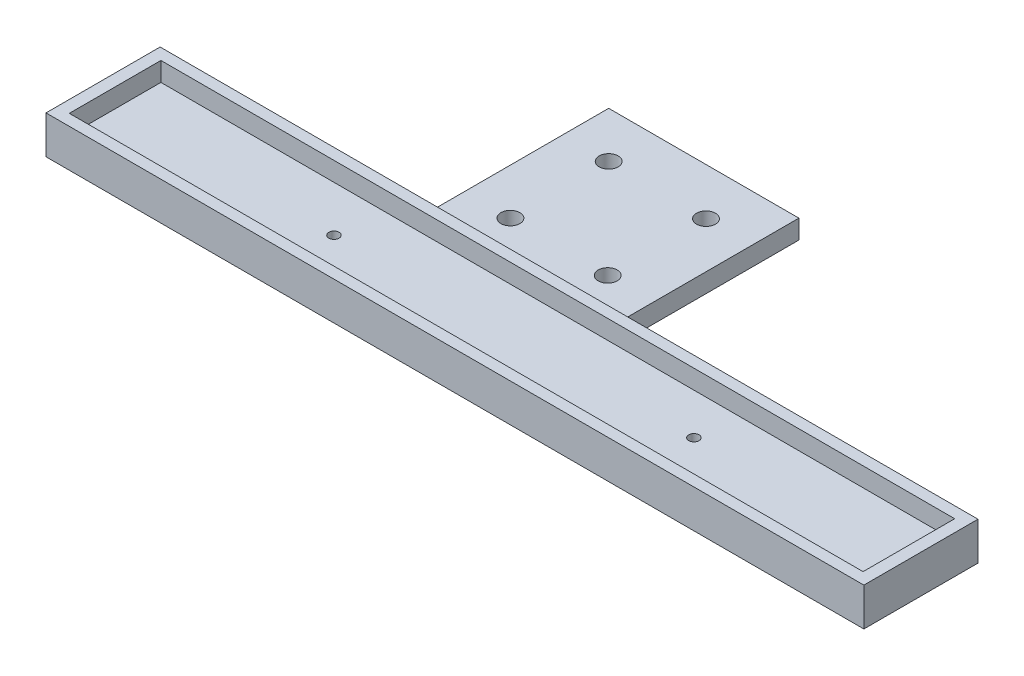
ISO-10303-21;
HEADER;
FILE_DESCRIPTION(('STEP AP214'),'2;1');
FILE_NAME('part.step','',(''),(''),'','','');
FILE_SCHEMA(('AUTOMOTIVE_DESIGN { 1 0 10303 214 1 1 1 1 }'));
ENDSEC;
DATA;
#1=APPLICATION_CONTEXT('core data for automotive mechanical design processes');
#2=APPLICATION_PROTOCOL_DEFINITION('international standard','automotive_design',2000,#1);
#3=PRODUCT_CONTEXT('',#1,'mechanical');
#4=PRODUCT('Part','Part','',(#3));
#5=PRODUCT_RELATED_PRODUCT_CATEGORY('part','',(#4));
#6=PRODUCT_DEFINITION_FORMATION('','',#4);
#7=PRODUCT_DEFINITION_CONTEXT('part definition',#1,'design');
#8=PRODUCT_DEFINITION('design','',#6,#7);
#9=PRODUCT_DEFINITION_SHAPE('','',#8);
#10=(LENGTH_UNIT() NAMED_UNIT(*) SI_UNIT(.MILLI.,.METRE.));
#11=(NAMED_UNIT(*) PLANE_ANGLE_UNIT() SI_UNIT($,.RADIAN.));
#12=(NAMED_UNIT(*) SI_UNIT($,.STERADIAN.) SOLID_ANGLE_UNIT());
#13=UNCERTAINTY_MEASURE_WITH_UNIT(LENGTH_MEASURE(1.E-05),#10,'distance_accuracy_value','');
#14=(GEOMETRIC_REPRESENTATION_CONTEXT(3) GLOBAL_UNCERTAINTY_ASSIGNED_CONTEXT((#13)) GLOBAL_UNIT_ASSIGNED_CONTEXT((#10,
#11,#12)) REPRESENTATION_CONTEXT('',''));
#15=CARTESIAN_POINT('',(0.,0.,0.));
#16=DIRECTION('',(0.,0.,1.));
#17=DIRECTION('',(1.,0.,0.));
#18=AXIS2_PLACEMENT_3D('',#15,#16,#17);
#19=CARTESIAN_POINT('',(64.4999999999998,3.,-9.00000000000003));
#20=DIRECTION('',(0.,0.,1.));
#21=DIRECTION('',(1.,0.,0.));
#22=AXIS2_PLACEMENT_3D('',#19,#20,#21);
#23=PLANE('',#22);
#24=DIRECTION('',(0.,-1.,0.));
#25=VECTOR('',#24,1.);
#26=CARTESIAN_POINT('',(6.2499999999998,0.,-9.00000000000001));
#27=LINE('',#26,#25);
#28=CARTESIAN_POINT('',(6.2499999999998,0.,-9.00000000000001));
#29=VERTEX_POINT('',#28);
#30=CARTESIAN_POINT('',(6.2499999999998,-3.,-9.00000000000001));
#31=VERTEX_POINT('',#30);
#32=EDGE_CURVE('E157',#29,#31,#27,.T.);
#33=ORIENTED_EDGE('',*,*,#32,.F.);
#34=DIRECTION('',(-1.,0.,0.));
#35=VECTOR('',#34,1.);
#36=CARTESIAN_POINT('',(-23.7500000000002,0.,-9.00000000000001));
#37=LINE('',#36,#35);
#38=CARTESIAN_POINT('',(-23.7500000000002,0.,-9.00000000000001));
#39=VERTEX_POINT('',#38);
#40=EDGE_CURVE('E129',#29,#39,#37,.T.);
#41=ORIENTED_EDGE('',*,*,#40,.T.);
#42=DIRECTION('',(0.,-1.,0.));
#43=VECTOR('',#42,1.);
#44=CARTESIAN_POINT('',(-23.7500000000002,0.,-9.00000000000001));
#45=LINE('',#44,#43);
#46=CARTESIAN_POINT('',(-23.7500000000002,-3.,-9.00000000000001));
#47=VERTEX_POINT('',#46);
#48=EDGE_CURVE('E141',#39,#47,#45,.T.);
#49=ORIENTED_EDGE('',*,*,#48,.T.);
#50=DIRECTION('',(1.,0.,0.));
#51=VECTOR('',#50,1.);
#52=CARTESIAN_POINT('',(64.4999999999998,-3.,-9.00000000000001));
#53=LINE('',#52,#51);
#54=CARTESIAN_POINT('',(-64.5000000000002,-3.,-9.00000000000001));
#55=VERTEX_POINT('',#54);
#56=EDGE_CURVE('E181',#55,#47,#53,.T.);
#57=ORIENTED_EDGE('',*,*,#56,.F.);
#58=DIRECTION('',(0.,-1.,0.));
#59=VECTOR('',#58,1.);
#60=CARTESIAN_POINT('',(-64.5000000000002,3.,-9.00000000000001));
#61=LINE('',#60,#59);
#62=CARTESIAN_POINT('',(-64.5000000000002,3.,-9.00000000000001));
#63=VERTEX_POINT('',#62);
#64=EDGE_CURVE('E221',#63,#55,#61,.T.);
#65=ORIENTED_EDGE('',*,*,#64,.F.);
#66=DIRECTION('',(-1.,0.,0.));
#67=VECTOR('',#66,1.);
#68=CARTESIAN_POINT('',(64.4999999999998,3.,-9.00000000000003));
#69=LINE('',#68,#67);
#70=CARTESIAN_POINT('',(64.4999999999998,3.,-9.00000000000003));
#71=VERTEX_POINT('',#70);
#72=EDGE_CURVE('E219',#71,#63,#69,.T.);
#73=ORIENTED_EDGE('',*,*,#72,.F.);
#74=DIRECTION('',(0.,-1.,0.));
#75=VECTOR('',#74,1.);
#76=CARTESIAN_POINT('',(64.4999999999998,3.,-9.00000000000003));
#77=LINE('',#76,#75);
#78=CARTESIAN_POINT('',(64.4999999999998,-3.,-9.00000000000001));
#79=VERTEX_POINT('',#78);
#80=EDGE_CURVE('E223',#71,#79,#77,.T.);
#81=ORIENTED_EDGE('',*,*,#80,.T.);
#82=EDGE_CURVE('E180',#31,#79,#53,.T.);
#83=ORIENTED_EDGE('',*,*,#82,.F.);
#84=EDGE_LOOP('',(#33,#41,#49,#57,#65,#73,#81,#83));
#85=FACE_BOUND('',#84,.T.);
#86=ADVANCED_FACE('F33',(#85),#23,.F.);
#87=CARTESIAN_POINT('',(0.,3.,0.));
#88=DIRECTION('',(0.,1.,0.));
#89=DIRECTION('',(0.,0.,1.));
#90=AXIS2_PLACEMENT_3D('',#87,#88,#89);
#91=PLANE('',#90);
#92=DIRECTION('',(0.,0.,1.));
#93=VECTOR('',#92,1.);
#94=CARTESIAN_POINT('',(-64.5000000000002,3.,8.99999999999999));
#95=LINE('',#94,#93);
#96=CARTESIAN_POINT('',(-64.5000000000002,3.,8.99999999999999));
#97=VERTEX_POINT('',#96);
#98=EDGE_CURVE('E212',#63,#97,#95,.T.);
#99=ORIENTED_EDGE('',*,*,#98,.T.);
#100=DIRECTION('',(1.,0.,0.));
#101=VECTOR('',#100,1.);
#102=CARTESIAN_POINT('',(64.4999999999998,3.,8.99999999999997));
#103=LINE('',#102,#101);
#104=CARTESIAN_POINT('',(64.4999999999998,3.,8.99999999999997));
#105=VERTEX_POINT('',#104);
#106=EDGE_CURVE('E215',#97,#105,#103,.T.);
#107=ORIENTED_EDGE('',*,*,#106,.T.);
#108=DIRECTION('',(0.,0.,-1.));
#109=VECTOR('',#108,1.);
#110=CARTESIAN_POINT('',(64.4999999999998,3.,8.99999999999997));
#111=LINE('',#110,#109);
#112=EDGE_CURVE('E217',#105,#71,#111,.T.);
#113=ORIENTED_EDGE('',*,*,#112,.T.);
#114=ORIENTED_EDGE('',*,*,#72,.T.);
#115=EDGE_LOOP('',(#99,#107,#113,#114));
#116=FACE_BOUND('',#115,.T.);
#117=DIRECTION('',(1.,0.,0.));
#118=VECTOR('',#117,1.);
#119=CARTESIAN_POINT('',(62.5999999999998,3.,7.22499999999995));
#120=LINE('',#119,#118);
#121=CARTESIAN_POINT('',(-62.6000000000002,3.,7.22499999999995));
#122=VERTEX_POINT('',#121);
#123=CARTESIAN_POINT('',(62.5999999999998,3.,7.22499999999995));
#124=VERTEX_POINT('',#123);
#125=EDGE_CURVE('E187',#122,#124,#120,.T.);
#126=ORIENTED_EDGE('',*,*,#125,.F.);
#127=DIRECTION('',(0.,0.,1.));
#128=VECTOR('',#127,1.);
#129=CARTESIAN_POINT('',(-62.6000000000002,3.,7.22499999999995));
#130=LINE('',#129,#128);
#131=CARTESIAN_POINT('',(-62.6000000000002,3.,-7.22500000000001));
#132=VERTEX_POINT('',#131);
#133=EDGE_CURVE('E185',#132,#122,#130,.T.);
#134=ORIENTED_EDGE('',*,*,#133,.F.);
#135=DIRECTION('',(-1.,0.,0.));
#136=VECTOR('',#135,1.);
#137=CARTESIAN_POINT('',(62.5999999999998,3.,-7.22500000000001));
#138=LINE('',#137,#136);
#139=CARTESIAN_POINT('',(62.5999999999998,3.,-7.22500000000001));
#140=VERTEX_POINT('',#139);
#141=EDGE_CURVE('E192',#140,#132,#138,.T.);
#142=ORIENTED_EDGE('',*,*,#141,.F.);
#143=DIRECTION('',(0.,0.,-1.));
#144=VECTOR('',#143,1.);
#145=CARTESIAN_POINT('',(62.5999999999998,3.,7.22499999999995));
#146=LINE('',#145,#144);
#147=EDGE_CURVE('E190',#124,#140,#146,.T.);
#148=ORIENTED_EDGE('',*,*,#147,.F.);
#149=EDGE_LOOP('',(#126,#134,#142,#148));
#150=FACE_BOUND('',#149,.T.);
#151=ADVANCED_FACE('F248',(#116,#150),#91,.T.);
#152=CARTESIAN_POINT('',(-64.5000000000002,3.,8.99999999999999));
#153=DIRECTION('',(1.,0.,0.));
#154=DIRECTION('',(0.,0.,-1.));
#155=AXIS2_PLACEMENT_3D('',#152,#153,#154);
#156=PLANE('',#155);
#157=ORIENTED_EDGE('',*,*,#64,.T.);
#158=DIRECTION('',(0.,0.,-1.));
#159=VECTOR('',#158,1.);
#160=CARTESIAN_POINT('',(-64.5000000000002,-3.,8.99999999999997));
#161=LINE('',#160,#159);
#162=CARTESIAN_POINT('',(-64.5000000000002,-3.,8.99999999999997));
#163=VERTEX_POINT('',#162);
#164=EDGE_CURVE('E177',#163,#55,#161,.T.);
#165=ORIENTED_EDGE('',*,*,#164,.F.);
#166=DIRECTION('',(0.,-1.,0.));
#167=VECTOR('',#166,1.);
#168=CARTESIAN_POINT('',(-64.5000000000002,3.,8.99999999999999));
#169=LINE('',#168,#167);
#170=EDGE_CURVE('E11',#97,#163,#169,.T.);
#171=ORIENTED_EDGE('',*,*,#170,.F.);
#172=ORIENTED_EDGE('',*,*,#98,.F.);
#173=EDGE_LOOP('',(#157,#165,#171,#172));
#174=FACE_BOUND('',#173,.T.);
#175=ADVANCED_FACE('F35',(#174),#156,.F.);
#176=CARTESIAN_POINT('',(64.4999999999998,3.,8.99999999999997));
#177=DIRECTION('',(0.,0.,-1.));
#178=DIRECTION('',(-1.,0.,0.));
#179=AXIS2_PLACEMENT_3D('',#176,#177,#178);
#180=PLANE('',#179);
#181=ORIENTED_EDGE('',*,*,#170,.T.);
#182=DIRECTION('',(-1.,0.,0.));
#183=VECTOR('',#182,1.);
#184=CARTESIAN_POINT('',(64.4999999999998,-3.,8.99999999999997));
#185=LINE('',#184,#183);
#186=CARTESIAN_POINT('',(64.4999999999998,-3.,8.99999999999997));
#187=VERTEX_POINT('',#186);
#188=EDGE_CURVE('E174',#187,#163,#185,.T.);
#189=ORIENTED_EDGE('',*,*,#188,.F.);
#190=DIRECTION('',(0.,-1.,0.));
#191=VECTOR('',#190,1.);
#192=CARTESIAN_POINT('',(64.4999999999998,3.,8.99999999999997));
#193=LINE('',#192,#191);
#194=EDGE_CURVE('E41',#105,#187,#193,.T.);
#195=ORIENTED_EDGE('',*,*,#194,.F.);
#196=ORIENTED_EDGE('',*,*,#106,.F.);
#197=EDGE_LOOP('',(#181,#189,#195,#196));
#198=FACE_BOUND('',#197,.T.);
#199=ADVANCED_FACE('F233',(#198),#180,.F.);
#200=CARTESIAN_POINT('',(64.4999999999998,3.,8.99999999999997));
#201=DIRECTION('',(-1.,0.,0.));
#202=DIRECTION('',(0.,0.,1.));
#203=AXIS2_PLACEMENT_3D('',#200,#201,#202);
#204=PLANE('',#203);
#205=ORIENTED_EDGE('',*,*,#194,.T.);
#206=DIRECTION('',(0.,0.,1.));
#207=VECTOR('',#206,1.);
#208=CARTESIAN_POINT('',(64.4999999999998,-3.,8.99999999999997));
#209=LINE('',#208,#207);
#210=EDGE_CURVE('E163',#79,#187,#209,.T.);
#211=ORIENTED_EDGE('',*,*,#210,.F.);
#212=ORIENTED_EDGE('',*,*,#80,.F.);
#213=ORIENTED_EDGE('',*,*,#112,.F.);
#214=EDGE_LOOP('',(#205,#211,#212,#213));
#215=FACE_BOUND('',#214,.T.);
#216=ADVANCED_FACE('F230',(#215),#204,.F.);
#217=CARTESIAN_POINT('',(-62.6000000000002,3.,7.22499999999995));
#218=DIRECTION('',(1.,0.,0.));
#219=DIRECTION('',(0.,0.,-1.));
#220=AXIS2_PLACEMENT_3D('',#217,#218,#219);
#221=PLANE('',#220);
#222=DIRECTION('',(0.,0.,1.));
#223=VECTOR('',#222,1.);
#224=CARTESIAN_POINT('',(-62.6000000000002,0.,7.22499999999995));
#225=LINE('',#224,#223);
#226=CARTESIAN_POINT('',(-62.6000000000002,0.,-7.22500000000001));
#227=VERTEX_POINT('',#226);
#228=CARTESIAN_POINT('',(-62.6000000000002,0.,7.22499999999995));
#229=VERTEX_POINT('',#228);
#230=EDGE_CURVE('E184',#227,#229,#225,.T.);
#231=ORIENTED_EDGE('',*,*,#230,.F.);
#232=DIRECTION('',(0.,-1.,0.));
#233=VECTOR('',#232,1.);
#234=CARTESIAN_POINT('',(-62.6000000000002,3.,-7.22500000000001));
#235=LINE('',#234,#233);
#236=EDGE_CURVE('E194',#132,#227,#235,.T.);
#237=ORIENTED_EDGE('',*,*,#236,.F.);
#238=ORIENTED_EDGE('',*,*,#133,.T.);
#239=DIRECTION('',(0.,-1.,0.));
#240=VECTOR('',#239,1.);
#241=CARTESIAN_POINT('',(-62.6000000000002,3.,7.22499999999995));
#242=LINE('',#241,#240);
#243=EDGE_CURVE('E209',#122,#229,#242,.T.);
#244=ORIENTED_EDGE('',*,*,#243,.T.);
#245=EDGE_LOOP('',(#231,#237,#238,#244));
#246=FACE_BOUND('',#245,.T.);
#247=ADVANCED_FACE('F272',(#246),#221,.T.);
#248=CARTESIAN_POINT('',(62.5999999999998,3.,7.22499999999995));
#249=DIRECTION('',(0.,0.,-1.));
#250=DIRECTION('',(-1.,0.,0.));
#251=AXIS2_PLACEMENT_3D('',#248,#249,#250);
#252=PLANE('',#251);
#253=DIRECTION('',(1.,0.,0.));
#254=VECTOR('',#253,1.);
#255=CARTESIAN_POINT('',(62.5999999999998,0.,7.22499999999995));
#256=LINE('',#255,#254);
#257=CARTESIAN_POINT('',(62.5999999999998,0.,7.22499999999995));
#258=VERTEX_POINT('',#257);
#259=EDGE_CURVE('E197',#229,#258,#256,.T.);
#260=ORIENTED_EDGE('',*,*,#259,.F.);
#261=ORIENTED_EDGE('',*,*,#243,.F.);
#262=ORIENTED_EDGE('',*,*,#125,.T.);
#263=DIRECTION('',(0.,-1.,0.));
#264=VECTOR('',#263,1.);
#265=CARTESIAN_POINT('',(62.5999999999998,3.,7.22499999999995));
#266=LINE('',#265,#264);
#267=EDGE_CURVE('E207',#124,#258,#266,.T.);
#268=ORIENTED_EDGE('',*,*,#267,.T.);
#269=EDGE_LOOP('',(#260,#261,#262,#268));
#270=FACE_BOUND('',#269,.T.);
#271=ADVANCED_FACE('F313',(#270),#252,.T.);
#272=CARTESIAN_POINT('',(62.5999999999998,3.,7.22499999999995));
#273=DIRECTION('',(-1.,0.,0.));
#274=DIRECTION('',(0.,0.,1.));
#275=AXIS2_PLACEMENT_3D('',#272,#273,#274);
#276=PLANE('',#275);
#277=DIRECTION('',(0.,0.,-1.));
#278=VECTOR('',#277,1.);
#279=CARTESIAN_POINT('',(62.5999999999998,0.,7.22499999999995));
#280=LINE('',#279,#278);
#281=CARTESIAN_POINT('',(62.5999999999998,0.,-7.22500000000001));
#282=VERTEX_POINT('',#281);
#283=EDGE_CURVE('E200',#258,#282,#280,.T.);
#284=ORIENTED_EDGE('',*,*,#283,.F.);
#285=ORIENTED_EDGE('',*,*,#267,.F.);
#286=ORIENTED_EDGE('',*,*,#147,.T.);
#287=DIRECTION('',(0.,-1.,0.));
#288=VECTOR('',#287,1.);
#289=CARTESIAN_POINT('',(62.5999999999998,3.,-7.22500000000001));
#290=LINE('',#289,#288);
#291=EDGE_CURVE('E56',#140,#282,#290,.T.);
#292=ORIENTED_EDGE('',*,*,#291,.T.);
#293=EDGE_LOOP('',(#284,#285,#286,#292));
#294=FACE_BOUND('',#293,.T.);
#295=ADVANCED_FACE('F321',(#294),#276,.T.);
#296=CARTESIAN_POINT('',(62.5999999999998,3.,-7.22500000000001));
#297=DIRECTION('',(0.,0.,1.));
#298=DIRECTION('',(1.,0.,0.));
#299=AXIS2_PLACEMENT_3D('',#296,#297,#298);
#300=PLANE('',#299);
#301=DIRECTION('',(-1.,0.,0.));
#302=VECTOR('',#301,1.);
#303=CARTESIAN_POINT('',(62.5999999999998,0.,-7.22500000000001));
#304=LINE('',#303,#302);
#305=EDGE_CURVE('E188',#282,#227,#304,.T.);
#306=ORIENTED_EDGE('',*,*,#305,.F.);
#307=ORIENTED_EDGE('',*,*,#291,.F.);
#308=ORIENTED_EDGE('',*,*,#141,.T.);
#309=ORIENTED_EDGE('',*,*,#236,.T.);
#310=EDGE_LOOP('',(#306,#307,#308,#309));
#311=FACE_BOUND('',#310,.T.);
#312=ADVANCED_FACE('F329',(#311),#300,.T.);
#313=CARTESIAN_POINT('',(0.,0.,0.));
#314=DIRECTION('',(0.,1.,0.));
#315=DIRECTION('',(0.,0.,1.));
#316=AXIS2_PLACEMENT_3D('',#313,#314,#315);
#317=PLANE('',#316);
#318=CARTESIAN_POINT('',(27.9699999999998,0.,-0.72500000000001));
#319=DIRECTION('',(0.,1.,0.));
#320=DIRECTION('',(0.,0.,1.));
#321=AXIS2_PLACEMENT_3D('',#318,#319,#320);
#322=CIRCLE('',#321,0.809999999999999);
#323=CARTESIAN_POINT('',(27.9699999999998,0.,0.0849999999999887));
#324=VERTEX_POINT('',#323);
#325=EDGE_CURVE('E164',#324,#324,#322,.T.);
#326=ORIENTED_EDGE('',*,*,#325,.F.);
#327=EDGE_LOOP('',(#326));
#328=FACE_BOUND('',#327,.T.);
#329=CARTESIAN_POINT('',(-28.0800000000002,0.,0.));
#330=DIRECTION('',(0.,1.,0.));
#331=DIRECTION('',(0.,0.,1.));
#332=AXIS2_PLACEMENT_3D('',#329,#330,#331);
#333=CIRCLE('',#332,0.809999999999999);
#334=CARTESIAN_POINT('',(-28.0800000000002,0.,0.809999999999999));
#335=VERTEX_POINT('',#334);
#336=EDGE_CURVE('E156',#335,#335,#333,.T.);
#337=ORIENTED_EDGE('',*,*,#336,.F.);
#338=EDGE_LOOP('',(#337));
#339=FACE_BOUND('',#338,.T.);
#340=ORIENTED_EDGE('',*,*,#305,.T.);
#341=ORIENTED_EDGE('',*,*,#230,.T.);
#342=ORIENTED_EDGE('',*,*,#259,.T.);
#343=ORIENTED_EDGE('',*,*,#283,.T.);
#344=EDGE_LOOP('',(#340,#341,#342,#343));
#345=FACE_BOUND('',#344,.T.);
#346=ADVANCED_FACE('F337',(#328,#339,#345),#317,.T.);
#347=CARTESIAN_POINT('',(0.,-3.,0.));
#348=DIRECTION('',(0.,1.,0.));
#349=DIRECTION('',(0.,0.,1.));
#350=AXIS2_PLACEMENT_3D('',#347,#348,#349);
#351=PLANE('',#350);
#352=CARTESIAN_POINT('',(27.9699999999998,-3.,-0.72500000000001));
#353=DIRECTION('',(0.,1.,0.));
#354=DIRECTION('',(0.,0.,1.));
#355=AXIS2_PLACEMENT_3D('',#352,#353,#354);
#356=CIRCLE('',#355,0.809999999999999);
#357=CARTESIAN_POINT('',(27.9699999999998,-3.,0.0849999999999887));
#358=VERTEX_POINT('',#357);
#359=EDGE_CURVE('E160',#358,#358,#356,.T.);
#360=ORIENTED_EDGE('',*,*,#359,.T.);
#361=EDGE_LOOP('',(#360));
#362=FACE_BOUND('',#361,.T.);
#363=CARTESIAN_POINT('',(-28.0800000000002,-3.,0.));
#364=DIRECTION('',(0.,1.,0.));
#365=DIRECTION('',(0.,0.,1.));
#366=AXIS2_PLACEMENT_3D('',#363,#364,#365);
#367=CIRCLE('',#366,0.809999999999999);
#368=CARTESIAN_POINT('',(-28.0800000000002,-3.,0.809999999999999));
#369=VERTEX_POINT('',#368);
#370=EDGE_CURVE('E167',#369,#369,#367,.T.);
#371=ORIENTED_EDGE('',*,*,#370,.T.);
#372=EDGE_LOOP('',(#371));
#373=FACE_BOUND('',#372,.T.);
#374=ORIENTED_EDGE('',*,*,#210,.T.);
#375=ORIENTED_EDGE('',*,*,#188,.T.);
#376=ORIENTED_EDGE('',*,*,#164,.T.);
#377=ORIENTED_EDGE('',*,*,#56,.T.);
#378=DIRECTION('',(0.,0.,-1.));
#379=VECTOR('',#378,1.);
#380=CARTESIAN_POINT('',(-23.7500000000002,-3.,-9.00000000000001));
#381=LINE('',#380,#379);
#382=CARTESIAN_POINT('',(-23.7500000000002,-3.,-39.));
#383=VERTEX_POINT('',#382);
#384=EDGE_CURVE('E48',#47,#383,#381,.T.);
#385=ORIENTED_EDGE('',*,*,#384,.T.);
#386=DIRECTION('',(1.,0.,0.));
#387=VECTOR('',#386,1.);
#388=CARTESIAN_POINT('',(-23.7500000000002,-3.,-39.));
#389=LINE('',#388,#387);
#390=CARTESIAN_POINT('',(6.2499999999998,-3.,-39.));
#391=VERTEX_POINT('',#390);
#392=EDGE_CURVE('E126',#383,#391,#389,.T.);
#393=ORIENTED_EDGE('',*,*,#392,.T.);
#394=DIRECTION('',(0.,0.,1.));
#395=VECTOR('',#394,1.);
#396=CARTESIAN_POINT('',(6.2499999999998,-3.,-9.00000000000001));
#397=LINE('',#396,#395);
#398=EDGE_CURVE('E142',#391,#31,#397,.T.);
#399=ORIENTED_EDGE('',*,*,#398,.T.);
#400=ORIENTED_EDGE('',*,*,#82,.T.);
#401=EDGE_LOOP('',(#374,#375,#376,#377,#385,#393,#399,#400));
#402=FACE_BOUND('',#401,.T.);
#403=CARTESIAN_POINT('',(-16.4992018378027,-3.,-16.2500000205504));
#404=DIRECTION('',(0.,-1.,0.));
#405=DIRECTION('',(0.,0.,-1.));
#406=AXIS2_PLACEMENT_3D('',#403,#404,#405);
#407=CIRCLE('',#406,1.5);
#408=CARTESIAN_POINT('',(-16.4992018378027,-3.,-17.7500000205504));
#409=VERTEX_POINT('',#408);
#410=EDGE_CURVE('E453',#409,#409,#407,.T.);
#411=ORIENTED_EDGE('',*,*,#410,.F.);
#412=EDGE_LOOP('',(#411));
#413=FACE_BOUND('',#412,.T.);
#414=CARTESIAN_POINT('',(-1.0000000000002,-3.,-16.0927028779885));
#415=DIRECTION('',(0.,-1.,0.));
#416=DIRECTION('',(0.,0.,-1.));
#417=AXIS2_PLACEMENT_3D('',#414,#415,#416);
#418=CIRCLE('',#417,1.5);
#419=CARTESIAN_POINT('',(-1.0000000000002,-3.,-17.5927028779885));
#420=VERTEX_POINT('',#419);
#421=EDGE_CURVE('E455',#420,#420,#418,.T.);
#422=ORIENTED_EDGE('',*,*,#421,.F.);
#423=EDGE_LOOP('',(#422));
#424=FACE_BOUND('',#423,.T.);
#425=CARTESIAN_POINT('',(-16.5000000000002,-3.,-31.75));
#426=DIRECTION('',(0.,-1.,0.));
#427=DIRECTION('',(0.,0.,-1.));
#428=AXIS2_PLACEMENT_3D('',#425,#426,#427);
#429=CIRCLE('',#428,1.5);
#430=CARTESIAN_POINT('',(-16.5000000000002,-3.,-33.25));
#431=VERTEX_POINT('',#430);
#432=EDGE_CURVE('E461',#431,#431,#429,.T.);
#433=ORIENTED_EDGE('',*,*,#432,.F.);
#434=EDGE_LOOP('',(#433));
#435=FACE_BOUND('',#434,.T.);
#436=CARTESIAN_POINT('',(-1.00079816219764,-3.,-31.5927028574381));
#437=DIRECTION('',(0.,-1.,0.));
#438=DIRECTION('',(0.,0.,-1.));
#439=AXIS2_PLACEMENT_3D('',#436,#437,#438);
#440=CIRCLE('',#439,1.5);
#441=CARTESIAN_POINT('',(-1.00079816219764,-3.,-33.0927028574381));
#442=VERTEX_POINT('',#441);
#443=EDGE_CURVE('E147',#442,#442,#440,.T.);
#444=ORIENTED_EDGE('',*,*,#443,.F.);
#445=EDGE_LOOP('',(#444));
#446=FACE_BOUND('',#445,.T.);
#447=ADVANCED_FACE('F237',(#362,#373,#402,#413,#424,#435,#446),#351,.F.);
#448=CARTESIAN_POINT('',(-28.0800000000002,-3.,0.));
#449=DIRECTION('',(0.,1.,0.));
#450=DIRECTION('',(0.,0.,1.));
#451=AXIS2_PLACEMENT_3D('',#448,#449,#450);
#452=CYLINDRICAL_SURFACE('',#451,0.809999999999999);
#453=ORIENTED_EDGE('',*,*,#370,.F.);
#454=EDGE_LOOP('',(#453));
#455=FACE_BOUND('',#454,.T.);
#456=ORIENTED_EDGE('',*,*,#336,.T.);
#457=EDGE_LOOP('',(#456));
#458=FACE_BOUND('',#457,.T.);
#459=ADVANCED_FACE('F352',(#455,#458),#452,.F.);
#460=CARTESIAN_POINT('',(27.9699999999998,-3.,-0.72500000000001));
#461=DIRECTION('',(0.,1.,0.));
#462=DIRECTION('',(0.,0.,1.));
#463=AXIS2_PLACEMENT_3D('',#460,#461,#462);
#464=CYLINDRICAL_SURFACE('',#463,0.809999999999999);
#465=ORIENTED_EDGE('',*,*,#359,.F.);
#466=EDGE_LOOP('',(#465));
#467=FACE_BOUND('',#466,.T.);
#468=ORIENTED_EDGE('',*,*,#325,.T.);
#469=EDGE_LOOP('',(#468));
#470=FACE_BOUND('',#469,.T.);
#471=ADVANCED_FACE('F260',(#467,#470),#464,.F.);
#472=CARTESIAN_POINT('',(-23.7500000000002,0.,-9.00000000000001));
#473=DIRECTION('',(-1.,0.,0.));
#474=DIRECTION('',(0.,0.,1.));
#475=AXIS2_PLACEMENT_3D('',#472,#473,#474);
#476=PLANE('',#475);
#477=ORIENTED_EDGE('',*,*,#384,.F.);
#478=ORIENTED_EDGE('',*,*,#48,.F.);
#479=DIRECTION('',(0.,0.,-1.));
#480=VECTOR('',#479,1.);
#481=CARTESIAN_POINT('',(-23.7500000000002,0.,-9.00000000000001));
#482=LINE('',#481,#480);
#483=CARTESIAN_POINT('',(-23.7500000000002,0.,-39.));
#484=VERTEX_POINT('',#483);
#485=EDGE_CURVE('E136',#39,#484,#482,.T.);
#486=ORIENTED_EDGE('',*,*,#485,.T.);
#487=DIRECTION('',(0.,-1.,0.));
#488=VECTOR('',#487,1.);
#489=CARTESIAN_POINT('',(-23.7500000000002,0.,-39.));
#490=LINE('',#489,#488);
#491=EDGE_CURVE('E121',#484,#383,#490,.T.);
#492=ORIENTED_EDGE('',*,*,#491,.T.);
#493=EDGE_LOOP('',(#477,#478,#486,#492));
#494=FACE_BOUND('',#493,.T.);
#495=ADVANCED_FACE('F140',(#494),#476,.T.);
#496=CARTESIAN_POINT('',(6.2499999999998,0.,-9.00000000000001));
#497=DIRECTION('',(1.,0.,0.));
#498=DIRECTION('',(0.,0.,-1.));
#499=AXIS2_PLACEMENT_3D('',#496,#497,#498);
#500=PLANE('',#499);
#501=ORIENTED_EDGE('',*,*,#398,.F.);
#502=DIRECTION('',(0.,-1.,0.));
#503=VECTOR('',#502,1.);
#504=CARTESIAN_POINT('',(6.2499999999998,0.,-39.));
#505=LINE('',#504,#503);
#506=CARTESIAN_POINT('',(6.2499999999998,0.,-39.));
#507=VERTEX_POINT('',#506);
#508=EDGE_CURVE('E128',#507,#391,#505,.T.);
#509=ORIENTED_EDGE('',*,*,#508,.F.);
#510=DIRECTION('',(0.,0.,1.));
#511=VECTOR('',#510,1.);
#512=CARTESIAN_POINT('',(6.2499999999998,0.,-9.00000000000001));
#513=LINE('',#512,#511);
#514=EDGE_CURVE('E138',#507,#29,#513,.T.);
#515=ORIENTED_EDGE('',*,*,#514,.T.);
#516=ORIENTED_EDGE('',*,*,#32,.T.);
#517=EDGE_LOOP('',(#501,#509,#515,#516));
#518=FACE_BOUND('',#517,.T.);
#519=ADVANCED_FACE('F252',(#518),#500,.T.);
#520=CARTESIAN_POINT('',(-23.7500000000002,0.,-39.));
#521=DIRECTION('',(0.,0.,-1.));
#522=DIRECTION('',(-1.,0.,0.));
#523=AXIS2_PLACEMENT_3D('',#520,#521,#522);
#524=PLANE('',#523);
#525=ORIENTED_EDGE('',*,*,#392,.F.);
#526=ORIENTED_EDGE('',*,*,#491,.F.);
#527=DIRECTION('',(1.,0.,0.));
#528=VECTOR('',#527,1.);
#529=CARTESIAN_POINT('',(-23.7500000000002,0.,-39.));
#530=LINE('',#529,#528);
#531=EDGE_CURVE('E124',#484,#507,#530,.T.);
#532=ORIENTED_EDGE('',*,*,#531,.T.);
#533=ORIENTED_EDGE('',*,*,#508,.T.);
#534=EDGE_LOOP('',(#525,#526,#532,#533));
#535=FACE_BOUND('',#534,.T.);
#536=ADVANCED_FACE('F123',(#535),#524,.T.);
#537=CARTESIAN_POINT('',(0.,0.,0.));
#538=DIRECTION('',(0.,-1.,0.));
#539=DIRECTION('',(0.,0.,-1.));
#540=AXIS2_PLACEMENT_3D('',#537,#538,#539);
#541=PLANE('',#540);
#542=CARTESIAN_POINT('',(-16.4992018378027,0.,-16.2500000205504));
#543=DIRECTION('',(0.,-1.,0.));
#544=DIRECTION('',(0.,0.,-1.));
#545=AXIS2_PLACEMENT_3D('',#542,#543,#544);
#546=CIRCLE('',#545,1.5);
#547=CARTESIAN_POINT('',(-16.4992018378027,0.,-17.7500000205504));
#548=VERTEX_POINT('',#547);
#549=EDGE_CURVE('E450',#548,#548,#546,.T.);
#550=ORIENTED_EDGE('',*,*,#549,.T.);
#551=EDGE_LOOP('',(#550));
#552=FACE_BOUND('',#551,.T.);
#553=CARTESIAN_POINT('',(-1.0000000000002,0.,-16.0927028779885));
#554=DIRECTION('',(0.,-1.,0.));
#555=DIRECTION('',(0.,0.,-1.));
#556=AXIS2_PLACEMENT_3D('',#553,#554,#555);
#557=CIRCLE('',#556,1.5);
#558=CARTESIAN_POINT('',(-1.0000000000002,0.,-17.5927028779885));
#559=VERTEX_POINT('',#558);
#560=EDGE_CURVE('E458',#559,#559,#557,.T.);
#561=ORIENTED_EDGE('',*,*,#560,.T.);
#562=EDGE_LOOP('',(#561));
#563=FACE_BOUND('',#562,.T.);
#564=CARTESIAN_POINT('',(-16.5000000000002,0.,-31.75));
#565=DIRECTION('',(0.,-1.,0.));
#566=DIRECTION('',(0.,0.,-1.));
#567=AXIS2_PLACEMENT_3D('',#564,#565,#566);
#568=CIRCLE('',#567,1.5);
#569=CARTESIAN_POINT('',(-16.5000000000002,0.,-33.25));
#570=VERTEX_POINT('',#569);
#571=EDGE_CURVE('E464',#570,#570,#568,.T.);
#572=ORIENTED_EDGE('',*,*,#571,.T.);
#573=EDGE_LOOP('',(#572));
#574=FACE_BOUND('',#573,.T.);
#575=CARTESIAN_POINT('',(-1.00079816219764,0.,-31.5927028574381));
#576=DIRECTION('',(0.,-1.,0.));
#577=DIRECTION('',(0.,0.,-1.));
#578=AXIS2_PLACEMENT_3D('',#575,#576,#577);
#579=CIRCLE('',#578,1.5);
#580=CARTESIAN_POINT('',(-1.00079816219764,0.,-33.0927028574381));
#581=VERTEX_POINT('',#580);
#582=EDGE_CURVE('E153',#581,#581,#579,.T.);
#583=ORIENTED_EDGE('',*,*,#582,.T.);
#584=EDGE_LOOP('',(#583));
#585=FACE_BOUND('',#584,.T.);
#586=ORIENTED_EDGE('',*,*,#485,.F.);
#587=ORIENTED_EDGE('',*,*,#40,.F.);
#588=ORIENTED_EDGE('',*,*,#514,.F.);
#589=ORIENTED_EDGE('',*,*,#531,.F.);
#590=EDGE_LOOP('',(#586,#587,#588,#589));
#591=FACE_BOUND('',#590,.T.);
#592=ADVANCED_FACE('F134',(#552,#563,#574,#585,#591),#541,.F.);
#593=CARTESIAN_POINT('',(-1.00079816219764,0.,-31.5927028574381));
#594=DIRECTION('',(0.,-1.,0.));
#595=DIRECTION('',(0.,0.,-1.));
#596=AXIS2_PLACEMENT_3D('',#593,#594,#595);
#597=CYLINDRICAL_SURFACE('',#596,1.5);
#598=ORIENTED_EDGE('',*,*,#582,.F.);
#599=EDGE_LOOP('',(#598));
#600=FACE_BOUND('',#599,.T.);
#601=ORIENTED_EDGE('',*,*,#443,.T.);
#602=EDGE_LOOP('',(#601));
#603=FACE_BOUND('',#602,.T.);
#604=ADVANCED_FACE('F404',(#600,#603),#597,.F.);
#605=CARTESIAN_POINT('',(-16.5000000000002,0.,-31.75));
#606=DIRECTION('',(0.,-1.,0.));
#607=DIRECTION('',(0.,0.,-1.));
#608=AXIS2_PLACEMENT_3D('',#605,#606,#607);
#609=CYLINDRICAL_SURFACE('',#608,1.5);
#610=ORIENTED_EDGE('',*,*,#571,.F.);
#611=EDGE_LOOP('',(#610));
#612=FACE_BOUND('',#611,.T.);
#613=ORIENTED_EDGE('',*,*,#432,.T.);
#614=EDGE_LOOP('',(#613));
#615=FACE_BOUND('',#614,.T.);
#616=ADVANCED_FACE('F413',(#612,#615),#609,.F.);
#617=CARTESIAN_POINT('',(-1.0000000000002,0.,-16.0927028779885));
#618=DIRECTION('',(0.,-1.,0.));
#619=DIRECTION('',(0.,0.,-1.));
#620=AXIS2_PLACEMENT_3D('',#617,#618,#619);
#621=CYLINDRICAL_SURFACE('',#620,1.5);
#622=ORIENTED_EDGE('',*,*,#560,.F.);
#623=EDGE_LOOP('',(#622));
#624=FACE_BOUND('',#623,.T.);
#625=ORIENTED_EDGE('',*,*,#421,.T.);
#626=EDGE_LOOP('',(#625));
#627=FACE_BOUND('',#626,.T.);
#628=ADVANCED_FACE('F423',(#624,#627),#621,.F.);
#629=CARTESIAN_POINT('',(-16.4992018378027,0.,-16.2500000205504));
#630=DIRECTION('',(0.,-1.,0.));
#631=DIRECTION('',(0.,0.,-1.));
#632=AXIS2_PLACEMENT_3D('',#629,#630,#631);
#633=CYLINDRICAL_SURFACE('',#632,1.5);
#634=ORIENTED_EDGE('',*,*,#549,.F.);
#635=EDGE_LOOP('',(#634));
#636=FACE_BOUND('',#635,.T.);
#637=ORIENTED_EDGE('',*,*,#410,.T.);
#638=EDGE_LOOP('',(#637));
#639=FACE_BOUND('',#638,.T.);
#640=ADVANCED_FACE('F433',(#636,#639),#633,.F.);
#641=CLOSED_SHELL('',(#86,#151,#175,#199,#216,#247,#271,#295,#312,#346,#447,#459,#471,#495,#519,
#536,#592,#604,#616,#628,#640));
#642=MANIFOLD_SOLID_BREP('B2',#641);
#643=ADVANCED_BREP_SHAPE_REPRESENTATION('',(#18,#642),#14);
#644=SHAPE_DEFINITION_REPRESENTATION(#9,#643);
ENDSEC;
END-ISO-10303-21;
